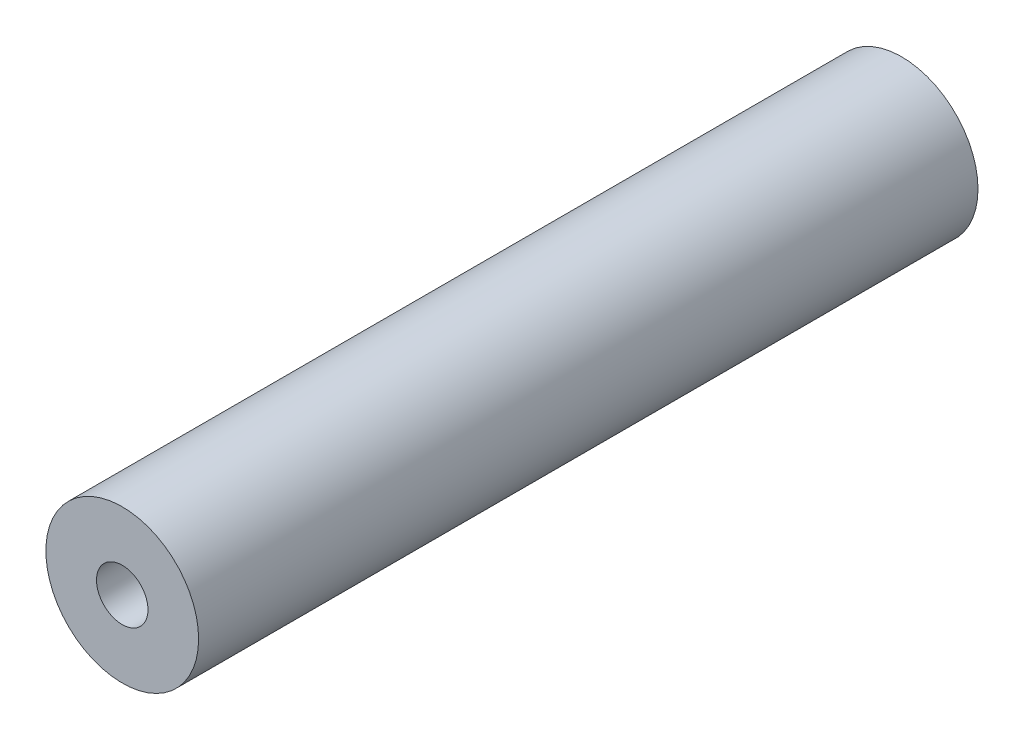
ISO-10303-21;
HEADER;
FILE_DESCRIPTION(('STEP AP214'),'2;1');
FILE_NAME('part.step','',(''),(''),'','','');
FILE_SCHEMA(('AUTOMOTIVE_DESIGN { 1 0 10303 214 1 1 1 1 }'));
ENDSEC;
DATA;
#1=APPLICATION_CONTEXT('core data for automotive mechanical design processes');
#2=APPLICATION_PROTOCOL_DEFINITION('international standard','automotive_design',2000,#1);
#3=PRODUCT_CONTEXT('',#1,'mechanical');
#4=PRODUCT('Part','Part','',(#3));
#5=PRODUCT_RELATED_PRODUCT_CATEGORY('part','',(#4));
#6=PRODUCT_DEFINITION_FORMATION('','',#4);
#7=PRODUCT_DEFINITION_CONTEXT('part definition',#1,'design');
#8=PRODUCT_DEFINITION('design','',#6,#7);
#9=PRODUCT_DEFINITION_SHAPE('','',#8);
#10=(LENGTH_UNIT() NAMED_UNIT(*) SI_UNIT(.MILLI.,.METRE.));
#11=(NAMED_UNIT(*) PLANE_ANGLE_UNIT() SI_UNIT($,.RADIAN.));
#12=(NAMED_UNIT(*) SI_UNIT($,.STERADIAN.) SOLID_ANGLE_UNIT());
#13=UNCERTAINTY_MEASURE_WITH_UNIT(LENGTH_MEASURE(1.E-05),#10,'distance_accuracy_value','');
#14=(GEOMETRIC_REPRESENTATION_CONTEXT(3) GLOBAL_UNCERTAINTY_ASSIGNED_CONTEXT((#13)) GLOBAL_UNIT_ASSIGNED_CONTEXT((#10,
#11,#12)) REPRESENTATION_CONTEXT('',''));
#15=CARTESIAN_POINT('',(0.,0.,0.));
#16=DIRECTION('',(0.,0.,1.));
#17=DIRECTION('',(1.,0.,0.));
#18=AXIS2_PLACEMENT_3D('',#15,#16,#17);
#19=CARTESIAN_POINT('',(0.,0.,50.));
#20=DIRECTION('',(0.,0.,-1.));
#21=DIRECTION('',(-1.,0.,0.));
#22=AXIS2_PLACEMENT_3D('',#19,#20,#21);
#23=CYLINDRICAL_SURFACE('',#22,4.9);
#24=CARTESIAN_POINT('',(0.,0.,50.));
#25=DIRECTION('',(0.,0.,1.));
#26=DIRECTION('',(1.,0.,0.));
#27=AXIS2_PLACEMENT_3D('',#24,#25,#26);
#28=CIRCLE('',#27,4.9);
#29=CARTESIAN_POINT('',(4.9,0.,50.));
#30=VERTEX_POINT('',#29);
#31=EDGE_CURVE('E11',#30,#30,#28,.T.);
#32=ORIENTED_EDGE('',*,*,#31,.F.);
#33=EDGE_LOOP('',(#32));
#34=FACE_BOUND('',#33,.T.);
#35=CARTESIAN_POINT('',(0.,0.,0.));
#36=DIRECTION('',(0.,0.,1.));
#37=DIRECTION('',(1.,0.,0.));
#38=AXIS2_PLACEMENT_3D('',#35,#36,#37);
#39=CIRCLE('',#38,4.9);
#40=CARTESIAN_POINT('',(4.9,0.,0.));
#41=VERTEX_POINT('',#40);
#42=EDGE_CURVE('E43',#41,#41,#39,.T.);
#43=ORIENTED_EDGE('',*,*,#42,.T.);
#44=EDGE_LOOP('',(#43));
#45=FACE_BOUND('',#44,.T.);
#46=ADVANCED_FACE('F40',(#34,#45),#23,.T.);
#47=CARTESIAN_POINT('',(0.,0.,50.));
#48=DIRECTION('',(0.,0.,1.));
#49=DIRECTION('',(1.,0.,0.));
#50=AXIS2_PLACEMENT_3D('',#47,#48,#49);
#51=PLANE('',#50);
#52=CARTESIAN_POINT('',(0.,0.,50.));
#53=DIRECTION('',(0.,0.,1.));
#54=DIRECTION('',(1.,0.,0.));
#55=AXIS2_PLACEMENT_3D('',#52,#53,#54);
#56=CIRCLE('',#55,1.65);
#57=CARTESIAN_POINT('',(1.65,0.,50.));
#58=VERTEX_POINT('',#57);
#59=EDGE_CURVE('E63',#58,#58,#56,.T.);
#60=ORIENTED_EDGE('',*,*,#59,.F.);
#61=EDGE_LOOP('',(#60));
#62=FACE_BOUND('',#61,.T.);
#63=ORIENTED_EDGE('',*,*,#31,.T.);
#64=EDGE_LOOP('',(#63));
#65=FACE_BOUND('',#64,.T.);
#66=ADVANCED_FACE('F82',(#62,#65),#51,.T.);
#67=CARTESIAN_POINT('',(0.,0.,0.));
#68=DIRECTION('',(0.,0.,1.));
#69=DIRECTION('',(1.,0.,0.));
#70=AXIS2_PLACEMENT_3D('',#67,#68,#69);
#71=PLANE('',#70);
#72=CARTESIAN_POINT('',(0.,0.,0.));
#73=DIRECTION('',(0.,0.,-1.));
#74=DIRECTION('',(-1.,0.,0.));
#75=AXIS2_PLACEMENT_3D('',#72,#73,#74);
#76=CIRCLE('',#75,1.64999999999999);
#77=CARTESIAN_POINT('',(-1.64999999999999,0.,0.));
#78=VERTEX_POINT('',#77);
#79=EDGE_CURVE('E64',#78,#78,#76,.T.);
#80=ORIENTED_EDGE('',*,*,#79,.F.);
#81=EDGE_LOOP('',(#80));
#82=FACE_BOUND('',#81,.T.);
#83=ORIENTED_EDGE('',*,*,#42,.F.);
#84=EDGE_LOOP('',(#83));
#85=FACE_BOUND('',#84,.T.);
#86=ADVANCED_FACE('F79',(#82,#85),#71,.F.);
#87=CARTESIAN_POINT('',(0.,0.,38.5));
#88=DIRECTION('',(0.,0.,1.));
#89=DIRECTION('',(1.,0.,0.));
#90=AXIS2_PLACEMENT_3D('',#87,#88,#89);
#91=CONICAL_SURFACE('',#90,1.65,1.02974425867665);
#92=CARTESIAN_POINT('',(0.,0.,37.5085799786045));
#93=VERTEX_POINT('',#92);
#94=VERTEX_LOOP('',#93);
#95=FACE_BOUND('',#94,.T.);
#96=CARTESIAN_POINT('',(0.,0.,38.5));
#97=DIRECTION('',(0.,0.,1.));
#98=DIRECTION('',(1.,0.,0.));
#99=AXIS2_PLACEMENT_3D('',#96,#97,#98);
#100=CIRCLE('',#99,1.65);
#101=CARTESIAN_POINT('',(1.65,0.,38.5));
#102=VERTEX_POINT('',#101);
#103=EDGE_CURVE('E67',#102,#102,#100,.T.);
#104=ORIENTED_EDGE('',*,*,#103,.T.);
#105=EDGE_LOOP('',(#104));
#106=FACE_BOUND('',#105,.T.);
#107=ADVANCED_FACE('F81',(#95,#106),#91,.F.);
#108=CARTESIAN_POINT('',(0.,0.,50.));
#109=DIRECTION('',(0.,0.,1.));
#110=DIRECTION('',(1.,0.,0.));
#111=AXIS2_PLACEMENT_3D('',#108,#109,#110);
#112=CYLINDRICAL_SURFACE('',#111,1.65);
#113=ORIENTED_EDGE('',*,*,#103,.F.);
#114=EDGE_LOOP('',(#113));
#115=FACE_BOUND('',#114,.T.);
#116=ORIENTED_EDGE('',*,*,#59,.T.);
#117=EDGE_LOOP('',(#116));
#118=FACE_BOUND('',#117,.T.);
#119=ADVANCED_FACE('F57',(#115,#118),#112,.F.);
#120=CARTESIAN_POINT('',(0.,0.,11.5));
#121=DIRECTION('',(0.,0.,-1.));
#122=DIRECTION('',(-1.,0.,0.));
#123=AXIS2_PLACEMENT_3D('',#120,#121,#122);
#124=CONICAL_SURFACE('',#123,1.64999999999999,1.02974425867665);
#125=CARTESIAN_POINT('',(0.,0.,12.4914200213955));
#126=VERTEX_POINT('',#125);
#127=VERTEX_LOOP('',#126);
#128=FACE_BOUND('',#127,.T.);
#129=CARTESIAN_POINT('',(0.,0.,11.5));
#130=DIRECTION('',(0.,0.,-1.));
#131=DIRECTION('',(-1.,0.,0.));
#132=AXIS2_PLACEMENT_3D('',#129,#130,#131);
#133=CIRCLE('',#132,1.64999999999999);
#134=CARTESIAN_POINT('',(-1.64999999999999,0.,11.5));
#135=VERTEX_POINT('',#134);
#136=EDGE_CURVE('E61',#135,#135,#133,.T.);
#137=ORIENTED_EDGE('',*,*,#136,.T.);
#138=EDGE_LOOP('',(#137));
#139=FACE_BOUND('',#138,.T.);
#140=ADVANCED_FACE('F53',(#128,#139),#124,.F.);
#141=CARTESIAN_POINT('',(0.,0.,0.));
#142=DIRECTION('',(0.,0.,-1.));
#143=DIRECTION('',(-1.,0.,0.));
#144=AXIS2_PLACEMENT_3D('',#141,#142,#143);
#145=CYLINDRICAL_SURFACE('',#144,1.64999999999999);
#146=ORIENTED_EDGE('',*,*,#136,.F.);
#147=EDGE_LOOP('',(#146));
#148=FACE_BOUND('',#147,.T.);
#149=ORIENTED_EDGE('',*,*,#79,.T.);
#150=EDGE_LOOP('',(#149));
#151=FACE_BOUND('',#150,.T.);
#152=ADVANCED_FACE('F56',(#148,#151),#145,.F.);
#153=CLOSED_SHELL('',(#46,#66,#86,#107,#119,#140,#152));
#154=MANIFOLD_SOLID_BREP('B2',#153);
#155=ADVANCED_BREP_SHAPE_REPRESENTATION('',(#18,#154),#14);
#156=SHAPE_DEFINITION_REPRESENTATION(#9,#155);
ENDSEC;
END-ISO-10303-21;
